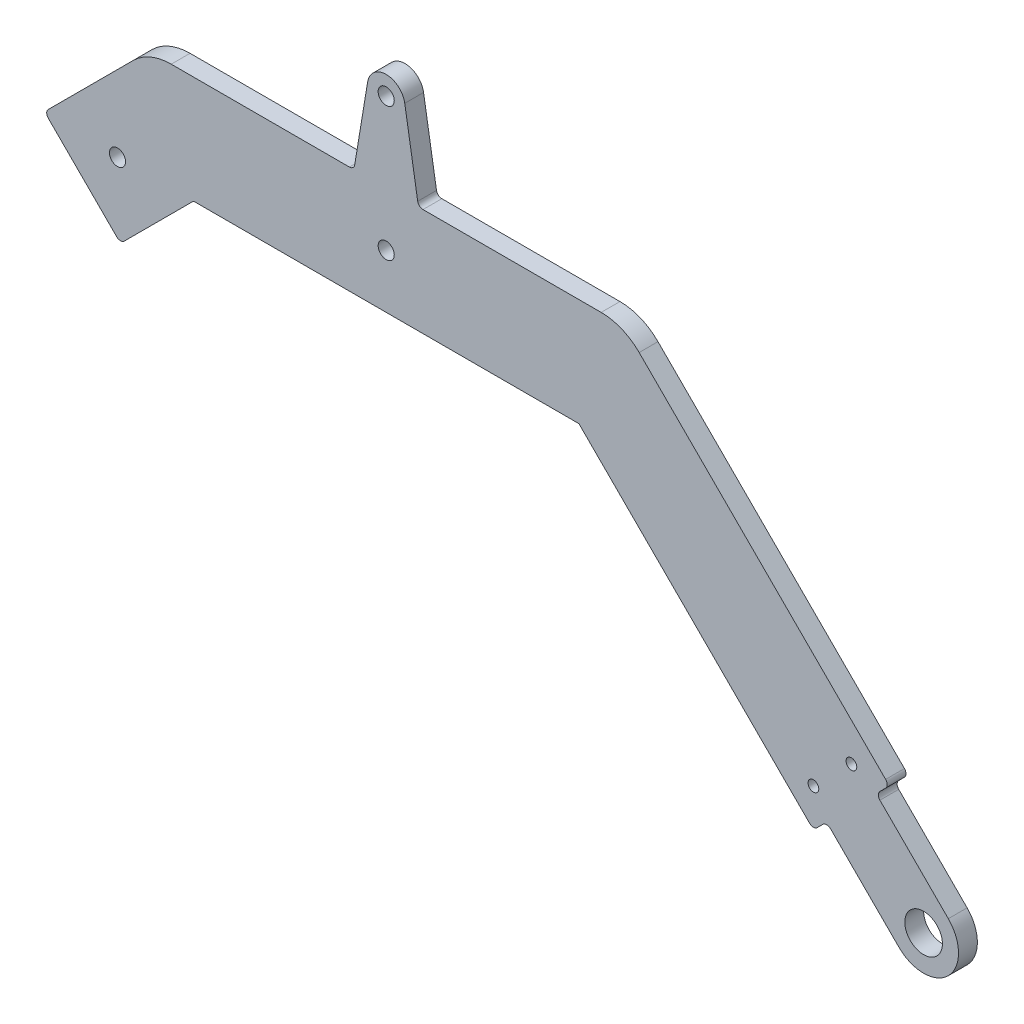
ISO-10303-21;
HEADER;
FILE_DESCRIPTION(('STEP AP214'),'2;1');
FILE_NAME('part.step','',(''),(''),'','','');
FILE_SCHEMA(('AUTOMOTIVE_DESIGN { 1 0 10303 214 1 1 1 1 }'));
ENDSEC;
DATA;
#1=APPLICATION_CONTEXT('core data for automotive mechanical design processes');
#2=APPLICATION_PROTOCOL_DEFINITION('international standard','automotive_design',2000,#1);
#3=PRODUCT_CONTEXT('',#1,'mechanical');
#4=PRODUCT('Part','Part','',(#3));
#5=PRODUCT_RELATED_PRODUCT_CATEGORY('part','',(#4));
#6=PRODUCT_DEFINITION_FORMATION('','',#4);
#7=PRODUCT_DEFINITION_CONTEXT('part definition',#1,'design');
#8=PRODUCT_DEFINITION('design','',#6,#7);
#9=PRODUCT_DEFINITION_SHAPE('','',#8);
#10=(LENGTH_UNIT() NAMED_UNIT(*) SI_UNIT(.MILLI.,.METRE.));
#11=(NAMED_UNIT(*) PLANE_ANGLE_UNIT() SI_UNIT($,.RADIAN.));
#12=(NAMED_UNIT(*) SI_UNIT($,.STERADIAN.) SOLID_ANGLE_UNIT());
#13=UNCERTAINTY_MEASURE_WITH_UNIT(LENGTH_MEASURE(1.E-05),#10,'distance_accuracy_value','');
#14=(GEOMETRIC_REPRESENTATION_CONTEXT(3) GLOBAL_UNCERTAINTY_ASSIGNED_CONTEXT((#13)) GLOBAL_UNIT_ASSIGNED_CONTEXT((#10,
#11,#12)) REPRESENTATION_CONTEXT('',''));
#15=CARTESIAN_POINT('',(0.,0.,0.));
#16=DIRECTION('',(0.,0.,1.));
#17=DIRECTION('',(1.,0.,0.));
#18=AXIS2_PLACEMENT_3D('',#15,#16,#17);
#19=CARTESIAN_POINT('',(100.,0.,3.5));
#20=DIRECTION('',(0.,0.,1.));
#21=DIRECTION('',(1.,0.,0.));
#22=AXIS2_PLACEMENT_3D('',#19,#20,#21);
#23=PLANE('',#22);
#24=CARTESIAN_POINT('',(79.4939033455901,13.4350288425444,3.5));
#25=DIRECTION('',(0.,0.,1.));
#26=DIRECTION('',(1.,0.,0.));
#27=AXIS2_PLACEMENT_3D('',#24,#25,#26);
#28=CIRCLE('',#27,0.999999999999998);
#29=CARTESIAN_POINT('',(80.4939033455901,13.4350288425444,3.5));
#30=VERTEX_POINT('',#29);
#31=EDGE_CURVE('E548',#30,#30,#28,.T.);
#32=ORIENTED_EDGE('',*,*,#31,.F.);
#33=EDGE_LOOP('',(#32));
#34=FACE_BOUND('',#33,.T.);
#35=CARTESIAN_POINT('',(100.,0.,3.5));
#36=DIRECTION('',(0.,0.,1.));
#37=DIRECTION('',(1.,0.,0.));
#38=AXIS2_PLACEMENT_3D('',#35,#36,#37);
#39=CIRCLE('',#38,3.50000000000001);
#40=CARTESIAN_POINT('',(103.5,0.,3.5));
#41=VERTEX_POINT('',#40);
#42=EDGE_CURVE('E532',#41,#41,#39,.T.);
#43=ORIENTED_EDGE('',*,*,#42,.F.);
#44=EDGE_LOOP('',(#43));
#45=FACE_BOUND('',#44,.T.);
#46=CARTESIAN_POINT('',(0.,84.85,3.5));
#47=DIRECTION('',(0.,0.,1.));
#48=DIRECTION('',(1.,0.,0.));
#49=AXIS2_PLACEMENT_3D('',#46,#47,#48);
#50=CIRCLE('',#49,1.5);
#51=CARTESIAN_POINT('',(1.5,84.85,3.5));
#52=VERTEX_POINT('',#51);
#53=EDGE_CURVE('E482',#52,#52,#50,.T.);
#54=ORIENTED_EDGE('',*,*,#53,.F.);
#55=EDGE_LOOP('',(#54));
#56=FACE_BOUND('',#55,.T.);
#57=DIRECTION('',(-0.707106781186547,-0.707106781186548,0.));
#58=VECTOR('',#57,1.);
#59=CARTESIAN_POINT('',(-44.1421356237309,70.,3.5));
#60=LINE('',#59,#58);
#61=CARTESIAN_POINT('',(-47.0710678118655,67.0710678118655,3.5));
#62=VERTEX_POINT('',#61);
#63=CARTESIAN_POINT('',(-62.8804653251744,51.2616702985565,3.5));
#64=VERTEX_POINT('',#63);
#65=EDGE_CURVE('E489',#62,#64,#60,.T.);
#66=ORIENTED_EDGE('',*,*,#65,.T.);
#67=CARTESIAN_POINT('',(-62.1733585439879,50.55456351737,3.5));
#68=DIRECTION('',(0.,0.,1.));
#69=DIRECTION('',(1.,0.,0.));
#70=AXIS2_PLACEMENT_3D('',#67,#68,#69);
#71=CIRCLE('',#70,1.);
#72=CARTESIAN_POINT('',(-62.8804653251744,49.8474567361834,3.5));
#73=VERTEX_POINT('',#72);
#74=EDGE_CURVE('E332',#64,#73,#71,.T.);
#75=ORIENTED_EDGE('',*,*,#74,.T.);
#76=DIRECTION('',(0.707106781186547,-0.707106781186548,0.));
#77=VECTOR('',#76,1.);
#78=CARTESIAN_POINT('',(-63.587572106361,50.55456351737,3.5));
#79=LINE('',#78,#77);
#80=CARTESIAN_POINT('',(-50.1525432638166,37.1195346748256,3.5));
#81=VERTEX_POINT('',#80);
#82=EDGE_CURVE('E485',#73,#81,#79,.T.);
#83=ORIENTED_EDGE('',*,*,#82,.T.);
#84=CARTESIAN_POINT('',(-49.44543648263,37.8266414560121,3.5));
#85=DIRECTION('',(0.,0.,1.));
#86=DIRECTION('',(1.,0.,0.));
#87=AXIS2_PLACEMENT_3D('',#84,#85,#86);
#88=CIRCLE('',#87,1.);
#89=CARTESIAN_POINT('',(-48.7383297014435,37.1195346748256,3.5));
#90=VERTEX_POINT('',#89);
#91=EDGE_CURVE('E329',#81,#90,#88,.T.);
#92=ORIENTED_EDGE('',*,*,#91,.T.);
#93=DIRECTION('',(0.707106781186547,0.707106781186548,0.));
#94=VECTOR('',#93,1.);
#95=CARTESIAN_POINT('',(-49.44543648263,36.412427893639,3.5));
#96=LINE('',#95,#94);
#97=CARTESIAN_POINT('',(-35.857864376269,50.,3.5));
#98=VERTEX_POINT('',#97);
#99=EDGE_CURVE('E232',#90,#98,#96,.T.);
#100=ORIENTED_EDGE('',*,*,#99,.T.);
#101=DIRECTION('',(1.,0.,0.));
#102=VECTOR('',#101,1.);
#103=CARTESIAN_POINT('',(-35.857864376269,50.,3.5));
#104=LINE('',#103,#102);
#105=CARTESIAN_POINT('',(35.8578643762691,50.,3.5));
#106=VERTEX_POINT('',#105);
#107=EDGE_CURVE('E226',#98,#106,#104,.T.);
#108=ORIENTED_EDGE('',*,*,#107,.T.);
#109=DIRECTION('',(0.707106781186548,-0.707106781186548,0.));
#110=VECTOR('',#109,1.);
#111=CARTESIAN_POINT('',(35.8578643762691,50.,3.5));
#112=LINE('',#111,#110);
#113=CARTESIAN_POINT('',(78.7867965644036,7.07106781186545,3.5));
#114=VERTEX_POINT('',#113);
#115=EDGE_CURVE('E213',#106,#114,#112,.T.);
#116=ORIENTED_EDGE('',*,*,#115,.T.);
#117=CARTESIAN_POINT('',(79.4939033455901,7.77817459305201,3.5));
#118=DIRECTION('',(0.,0.,1.));
#119=DIRECTION('',(1.,0.,0.));
#120=AXIS2_PLACEMENT_3D('',#117,#118,#119);
#121=CIRCLE('',#120,1.);
#122=CARTESIAN_POINT('',(80.2010101267767,7.07106781186547,3.5));
#123=VERTEX_POINT('',#122);
#124=EDGE_CURVE('E326',#114,#123,#121,.T.);
#125=ORIENTED_EDGE('',*,*,#124,.T.);
#126=DIRECTION('',(0.707106781186545,0.70710678118655,0.));
#127=VECTOR('',#126,1.);
#128=CARTESIAN_POINT('',(79.4939033455901,6.36396103067892,3.5));
#129=LINE('',#128,#127);
#130=CARTESIAN_POINT('',(81.2616702985566,8.13172798364534,3.5));
#131=VERTEX_POINT('',#130);
#132=EDGE_CURVE('E225',#123,#131,#129,.T.);
#133=ORIENTED_EDGE('',*,*,#132,.T.);
#134=CARTESIAN_POINT('',(81.9687770797431,7.4246212024588,3.5));
#135=DIRECTION('',(0.,0.,1.));
#136=DIRECTION('',(1.,0.,0.));
#137=AXIS2_PLACEMENT_3D('',#134,#135,#136);
#138=CIRCLE('',#137,1.);
#139=CARTESIAN_POINT('',(82.6758838609296,8.13172798364534,3.5));
#140=VERTEX_POINT('',#139);
#141=EDGE_CURVE('E355',#131,#140,#138,.F.);
#142=ORIENTED_EDGE('',*,*,#141,.T.);
#143=DIRECTION('',(0.707106781186545,-0.70710678118655,0.));
#144=VECTOR('',#143,1.);
#145=CARTESIAN_POINT('',(81.9687770797431,8.83883476483189,3.5));
#146=LINE('',#145,#144);
#147=CARTESIAN_POINT('',(95.4038059222874,-4.59619407771253,3.5));
#148=VERTEX_POINT('',#147);
#149=EDGE_CURVE('E514',#140,#148,#146,.T.);
#150=ORIENTED_EDGE('',*,*,#149,.T.);
#151=CARTESIAN_POINT('',(100.,0.,3.5));
#152=DIRECTION('',(0.,0.,1.));
#153=DIRECTION('',(1.,0.,0.));
#154=AXIS2_PLACEMENT_3D('',#151,#152,#153);
#155=CIRCLE('',#154,6.5);
#156=CARTESIAN_POINT('',(104.596194077713,4.59619407771258,3.5));
#157=VERTEX_POINT('',#156);
#158=EDGE_CURVE('E511',#148,#157,#155,.T.);
#159=ORIENTED_EDGE('',*,*,#158,.T.);
#160=DIRECTION('',(-0.707106781186548,0.707106781186547,0.));
#161=VECTOR('',#160,1.);
#162=CARTESIAN_POINT('',(104.596194077713,4.59619407771258,3.5));
#163=LINE('',#162,#161);
#164=CARTESIAN_POINT('',(91.8682720163547,17.3241161390704,3.5));
#165=VERTEX_POINT('',#164);
#166=EDGE_CURVE('E456',#157,#165,#163,.T.);
#167=ORIENTED_EDGE('',*,*,#166,.T.);
#168=CARTESIAN_POINT('',(92.5753787975413,18.031222920257,3.5));
#169=DIRECTION('',(0.,0.,1.));
#170=DIRECTION('',(1.,0.,0.));
#171=AXIS2_PLACEMENT_3D('',#168,#169,#170);
#172=CIRCLE('',#171,1.);
#173=CARTESIAN_POINT('',(91.8682720163547,18.7383297014435,3.5));
#174=VERTEX_POINT('',#173);
#175=EDGE_CURVE('E304',#165,#174,#172,.F.);
#176=ORIENTED_EDGE('',*,*,#175,.T.);
#177=DIRECTION('',(0.707106781186551,0.707106781186544,0.));
#178=VECTOR('',#177,1.);
#179=CARTESIAN_POINT('',(91.1611652351682,18.031222920257,3.5));
#180=LINE('',#179,#178);
#181=CARTESIAN_POINT('',(92.9289321881345,19.7989898732233,3.5));
#182=VERTEX_POINT('',#181);
#183=EDGE_CURVE('E505',#174,#182,#180,.T.);
#184=ORIENTED_EDGE('',*,*,#183,.T.);
#185=CARTESIAN_POINT('',(92.221825406948,20.5060966544099,3.5));
#186=DIRECTION('',(0.,0.,1.));
#187=DIRECTION('',(1.,0.,0.));
#188=AXIS2_PLACEMENT_3D('',#185,#186,#187);
#189=CIRCLE('',#188,1.);
#190=CARTESIAN_POINT('',(92.9289321881345,21.2132034355964,3.5));
#191=VERTEX_POINT('',#190);
#192=EDGE_CURVE('E295',#182,#191,#189,.T.);
#193=ORIENTED_EDGE('',*,*,#192,.T.);
#194=DIRECTION('',(-0.707106781186547,0.707106781186548,0.));
#195=VECTOR('',#194,1.);
#196=CARTESIAN_POINT('',(93.6360389693211,20.5060966544099,3.5));
#197=LINE('',#196,#195);
#198=CARTESIAN_POINT('',(47.0710678118655,67.0710678118655,3.5));
#199=VERTEX_POINT('',#198);
#200=EDGE_CURVE('E502',#191,#199,#197,.T.);
#201=ORIENTED_EDGE('',*,*,#200,.T.);
#202=CARTESIAN_POINT('',(40.,60.,3.5));
#203=DIRECTION('',(0.,0.,1.));
#204=DIRECTION('',(1.,0.,0.));
#205=AXIS2_PLACEMENT_3D('',#202,#203,#204);
#206=CIRCLE('',#205,10.);
#207=CARTESIAN_POINT('',(40.,70.,3.5));
#208=VERTEX_POINT('',#207);
#209=EDGE_CURVE('E267',#199,#208,#206,.T.);
#210=ORIENTED_EDGE('',*,*,#209,.T.);
#211=DIRECTION('',(-1.,0.,0.));
#212=VECTOR('',#211,1.);
#213=CARTESIAN_POINT('',(44.142135623731,70.,3.5));
#214=LINE('',#213,#212);
#215=CARTESIAN_POINT('',(6.84838937711763,70.,3.5));
#216=VERTEX_POINT('',#215);
#217=EDGE_CURVE('E383',#208,#216,#214,.T.);
#218=ORIENTED_EDGE('',*,*,#217,.T.);
#219=CARTESIAN_POINT('',(6.84838937711763,71.,3.5));
#220=DIRECTION('',(0.,0.,1.));
#221=DIRECTION('',(1.,0.,0.));
#222=AXIS2_PLACEMENT_3D('',#219,#220,#221);
#223=CIRCLE('',#222,1.);
#224=CARTESIAN_POINT('',(5.8617550329968,70.8370500966516,3.5));
#225=VERTEX_POINT('',#224);
#226=EDGE_CURVE('E374',#216,#225,#223,.F.);
#227=ORIENTED_EDGE('',*,*,#226,.T.);
#228=DIRECTION('',(-0.16294990334848,0.98663434412082,0.));
#229=VECTOR('',#228,1.);
#230=CARTESIAN_POINT('',(3.45322020442287,85.4203246617197,3.5));
#231=LINE('',#230,#229);
#232=CARTESIAN_POINT('',(3.45322020442287,85.4203246617197,3.5));
#233=VERTEX_POINT('',#232);
#234=EDGE_CURVE('E380',#225,#233,#231,.T.);
#235=ORIENTED_EDGE('',*,*,#234,.T.);
#236=CARTESIAN_POINT('',(0.,84.85,3.5));
#237=DIRECTION('',(0.,0.,1.));
#238=DIRECTION('',(1.,0.,0.));
#239=AXIS2_PLACEMENT_3D('',#236,#237,#238);
#240=CIRCLE('',#239,3.5);
#241=CARTESIAN_POINT('',(-3.45322020442287,85.4203246617197,3.5));
#242=VERTEX_POINT('',#241);
#243=EDGE_CURVE('E394',#233,#242,#240,.T.);
#244=ORIENTED_EDGE('',*,*,#243,.T.);
#245=DIRECTION('',(-0.16294990334848,-0.98663434412082,0.));
#246=VECTOR('',#245,1.);
#247=CARTESIAN_POINT('',(-3.45322020442287,85.4203246617197,3.5));
#248=LINE('',#247,#246);
#249=CARTESIAN_POINT('',(-5.8617550329968,70.8370500966516,3.5));
#250=VERTEX_POINT('',#249);
#251=EDGE_CURVE('E495',#242,#250,#248,.T.);
#252=ORIENTED_EDGE('',*,*,#251,.T.);
#253=CARTESIAN_POINT('',(-6.84838937711762,71.,3.5));
#254=DIRECTION('',(0.,0.,1.));
#255=DIRECTION('',(1.,0.,0.));
#256=AXIS2_PLACEMENT_3D('',#253,#254,#255);
#257=CIRCLE('',#256,1.);
#258=CARTESIAN_POINT('',(-6.84838937711762,70.,3.5));
#259=VERTEX_POINT('',#258);
#260=EDGE_CURVE('E11',#250,#259,#257,.F.);
#261=ORIENTED_EDGE('',*,*,#260,.T.);
#262=DIRECTION('',(-1.,0.,0.));
#263=VECTOR('',#262,1.);
#264=CARTESIAN_POINT('',(-6.,70.,3.5));
#265=LINE('',#264,#263);
#266=CARTESIAN_POINT('',(-40.,70.,3.5));
#267=VERTEX_POINT('',#266);
#268=EDGE_CURVE('E492',#259,#267,#265,.T.);
#269=ORIENTED_EDGE('',*,*,#268,.T.);
#270=CARTESIAN_POINT('',(-40.,60.,3.5));
#271=DIRECTION('',(0.,0.,1.));
#272=DIRECTION('',(1.,0.,0.));
#273=AXIS2_PLACEMENT_3D('',#270,#271,#272);
#274=CIRCLE('',#273,10.);
#275=EDGE_CURVE('E270',#267,#62,#274,.T.);
#276=ORIENTED_EDGE('',*,*,#275,.T.);
#277=EDGE_LOOP('',(#66,#75,#83,#92,#100,#108,#116,#125,#133,#142,#150,#159,#167,#176,#184,#193,
#201,#210,#218,#227,#235,#244,#252,#261,#269,#276));
#278=FACE_BOUND('',#277,.T.);
#279=CARTESIAN_POINT('',(0.,60.,3.5));
#280=DIRECTION('',(0.,0.,1.));
#281=DIRECTION('',(1.,0.,0.));
#282=AXIS2_PLACEMENT_3D('',#279,#280,#281);
#283=CIRCLE('',#282,1.5);
#284=CARTESIAN_POINT('',(1.50000000000002,60.,3.5));
#285=VERTEX_POINT('',#284);
#286=EDGE_CURVE('E524',#285,#285,#283,.T.);
#287=ORIENTED_EDGE('',*,*,#286,.F.);
#288=EDGE_LOOP('',(#287));
#289=FACE_BOUND('',#288,.T.);
#290=CARTESIAN_POINT('',(86.5649711574556,20.5060966544099,3.5));
#291=DIRECTION('',(0.,0.,1.));
#292=DIRECTION('',(1.,0.,0.));
#293=AXIS2_PLACEMENT_3D('',#290,#291,#292);
#294=CIRCLE('',#293,0.999999999999998);
#295=CARTESIAN_POINT('',(87.5649711574556,20.5060966544099,3.5));
#296=VERTEX_POINT('',#295);
#297=EDGE_CURVE('E540',#296,#296,#294,.T.);
#298=ORIENTED_EDGE('',*,*,#297,.F.);
#299=EDGE_LOOP('',(#298));
#300=FACE_BOUND('',#299,.T.);
#301=CARTESIAN_POINT('',(-50.,50.,3.5));
#302=DIRECTION('',(0.,0.,1.));
#303=DIRECTION('',(1.,0.,0.));
#304=AXIS2_PLACEMENT_3D('',#301,#302,#303);
#305=CIRCLE('',#304,1.5);
#306=CARTESIAN_POINT('',(-48.5,50.,3.5));
#307=VERTEX_POINT('',#306);
#308=EDGE_CURVE('E556',#307,#307,#305,.T.);
#309=ORIENTED_EDGE('',*,*,#308,.F.);
#310=EDGE_LOOP('',(#309));
#311=FACE_BOUND('',#310,.T.);
#312=ADVANCED_FACE('F39',(#34,#45,#56,#278,#289,#300,#311),#23,.T.);
#313=CARTESIAN_POINT('',(100.,0.,0.));
#314=DIRECTION('',(0.,0.,1.));
#315=DIRECTION('',(1.,0.,0.));
#316=AXIS2_PLACEMENT_3D('',#313,#314,#315);
#317=PLANE('',#316);
#318=DIRECTION('',(0.707106781186547,-0.707106781186548,0.));
#319=VECTOR('',#318,1.);
#320=CARTESIAN_POINT('',(-63.587572106361,50.55456351737,0.));
#321=LINE('',#320,#319);
#322=CARTESIAN_POINT('',(-62.8804653251744,49.8474567361834,0.));
#323=VERTEX_POINT('',#322);
#324=CARTESIAN_POINT('',(-50.1525432638166,37.1195346748256,0.));
#325=VERTEX_POINT('',#324);
#326=EDGE_CURVE('E431',#323,#325,#321,.T.);
#327=ORIENTED_EDGE('',*,*,#326,.F.);
#328=CARTESIAN_POINT('',(-62.1733585439879,50.55456351737,0.));
#329=DIRECTION('',(0.,0.,1.));
#330=DIRECTION('',(1.,0.,0.));
#331=AXIS2_PLACEMENT_3D('',#328,#329,#330);
#332=CIRCLE('',#331,1.);
#333=CARTESIAN_POINT('',(-62.8804653251744,51.2616702985565,0.));
#334=VERTEX_POINT('',#333);
#335=EDGE_CURVE('E320',#323,#334,#332,.F.);
#336=ORIENTED_EDGE('',*,*,#335,.T.);
#337=DIRECTION('',(-0.707106781186547,-0.707106781186548,0.));
#338=VECTOR('',#337,1.);
#339=CARTESIAN_POINT('',(-44.1421356237309,70.,0.));
#340=LINE('',#339,#338);
#341=CARTESIAN_POINT('',(-47.0710678118655,67.0710678118655,0.));
#342=VERTEX_POINT('',#341);
#343=EDGE_CURVE('E427',#342,#334,#340,.T.);
#344=ORIENTED_EDGE('',*,*,#343,.F.);
#345=CARTESIAN_POINT('',(-40.,60.,0.));
#346=DIRECTION('',(0.,0.,1.));
#347=DIRECTION('',(1.,0.,0.));
#348=AXIS2_PLACEMENT_3D('',#345,#346,#347);
#349=CIRCLE('',#348,10.);
#350=CARTESIAN_POINT('',(-40.,70.,0.));
#351=VERTEX_POINT('',#350);
#352=EDGE_CURVE('E259',#342,#351,#349,.F.);
#353=ORIENTED_EDGE('',*,*,#352,.T.);
#354=DIRECTION('',(-1.,0.,0.));
#355=VECTOR('',#354,1.);
#356=CARTESIAN_POINT('',(-6.,70.,0.));
#357=LINE('',#356,#355);
#358=CARTESIAN_POINT('',(-6.84838937711762,70.,0.));
#359=VERTEX_POINT('',#358);
#360=EDGE_CURVE('E424',#359,#351,#357,.T.);
#361=ORIENTED_EDGE('',*,*,#360,.F.);
#362=CARTESIAN_POINT('',(-6.84838937711762,71.,0.));
#363=DIRECTION('',(0.,0.,1.));
#364=DIRECTION('',(1.,0.,0.));
#365=AXIS2_PLACEMENT_3D('',#362,#363,#364);
#366=CIRCLE('',#365,1.);
#367=CARTESIAN_POINT('',(-5.8617550329968,70.8370500966516,0.));
#368=VERTEX_POINT('',#367);
#369=EDGE_CURVE('E48',#359,#368,#366,.T.);
#370=ORIENTED_EDGE('',*,*,#369,.T.);
#371=DIRECTION('',(-0.16294990334848,-0.98663434412082,0.));
#372=VECTOR('',#371,1.);
#373=CARTESIAN_POINT('',(-3.45322020442287,85.4203246617197,0.));
#374=LINE('',#373,#372);
#375=CARTESIAN_POINT('',(-3.45322020442287,85.4203246617197,0.));
#376=VERTEX_POINT('',#375);
#377=EDGE_CURVE('E421',#376,#368,#374,.T.);
#378=ORIENTED_EDGE('',*,*,#377,.F.);
#379=CARTESIAN_POINT('',(0.,84.85,0.));
#380=DIRECTION('',(0.,0.,1.));
#381=DIRECTION('',(1.,0.,0.));
#382=AXIS2_PLACEMENT_3D('',#379,#380,#381);
#383=CIRCLE('',#382,3.5);
#384=CARTESIAN_POINT('',(3.45322020442287,85.4203246617197,0.));
#385=VERTEX_POINT('',#384);
#386=EDGE_CURVE('E413',#385,#376,#383,.T.);
#387=ORIENTED_EDGE('',*,*,#386,.F.);
#388=DIRECTION('',(-0.16294990334848,0.98663434412082,0.));
#389=VECTOR('',#388,1.);
#390=CARTESIAN_POINT('',(3.45322020442287,85.4203246617197,0.));
#391=LINE('',#390,#389);
#392=CARTESIAN_POINT('',(5.8617550329968,70.8370500966516,0.));
#393=VERTEX_POINT('',#392);
#394=EDGE_CURVE('E404',#393,#385,#391,.T.);
#395=ORIENTED_EDGE('',*,*,#394,.F.);
#396=CARTESIAN_POINT('',(6.84838937711763,71.,0.));
#397=DIRECTION('',(0.,0.,1.));
#398=DIRECTION('',(1.,0.,0.));
#399=AXIS2_PLACEMENT_3D('',#396,#397,#398);
#400=CIRCLE('',#399,1.);
#401=CARTESIAN_POINT('',(6.84838937711763,70.,0.));
#402=VERTEX_POINT('',#401);
#403=EDGE_CURVE('E371',#393,#402,#400,.T.);
#404=ORIENTED_EDGE('',*,*,#403,.T.);
#405=DIRECTION('',(-1.,0.,0.));
#406=VECTOR('',#405,1.);
#407=CARTESIAN_POINT('',(44.142135623731,70.,0.));
#408=LINE('',#407,#406);
#409=CARTESIAN_POINT('',(40.,70.,0.));
#410=VERTEX_POINT('',#409);
#411=EDGE_CURVE('E402',#410,#402,#408,.T.);
#412=ORIENTED_EDGE('',*,*,#411,.F.);
#413=CARTESIAN_POINT('',(40.,60.,0.));
#414=DIRECTION('',(0.,0.,1.));
#415=DIRECTION('',(1.,0.,0.));
#416=AXIS2_PLACEMENT_3D('',#413,#414,#415);
#417=CIRCLE('',#416,10.);
#418=CARTESIAN_POINT('',(47.0710678118655,67.0710678118655,0.));
#419=VERTEX_POINT('',#418);
#420=EDGE_CURVE('E249',#410,#419,#417,.F.);
#421=ORIENTED_EDGE('',*,*,#420,.T.);
#422=DIRECTION('',(-0.707106781186547,0.707106781186548,0.));
#423=VECTOR('',#422,1.);
#424=CARTESIAN_POINT('',(93.6360389693211,20.5060966544099,0.));
#425=LINE('',#424,#423);
#426=CARTESIAN_POINT('',(92.9289321881345,21.2132034355964,0.));
#427=VERTEX_POINT('',#426);
#428=EDGE_CURVE('E409',#427,#419,#425,.T.);
#429=ORIENTED_EDGE('',*,*,#428,.F.);
#430=CARTESIAN_POINT('',(92.221825406948,20.5060966544099,0.));
#431=DIRECTION('',(0.,0.,1.));
#432=DIRECTION('',(1.,0.,0.));
#433=AXIS2_PLACEMENT_3D('',#430,#431,#432);
#434=CIRCLE('',#433,1.);
#435=CARTESIAN_POINT('',(92.9289321881345,19.7989898732233,0.));
#436=VERTEX_POINT('',#435);
#437=EDGE_CURVE('E285',#427,#436,#434,.F.);
#438=ORIENTED_EDGE('',*,*,#437,.T.);
#439=DIRECTION('',(0.707106781186551,0.707106781186544,0.));
#440=VECTOR('',#439,1.);
#441=CARTESIAN_POINT('',(91.1611652351682,18.031222920257,0.));
#442=LINE('',#441,#440);
#443=CARTESIAN_POINT('',(91.8682720163547,18.7383297014435,0.));
#444=VERTEX_POINT('',#443);
#445=EDGE_CURVE('E415',#444,#436,#442,.T.);
#446=ORIENTED_EDGE('',*,*,#445,.F.);
#447=CARTESIAN_POINT('',(92.5753787975413,18.031222920257,0.));
#448=DIRECTION('',(0.,0.,1.));
#449=DIRECTION('',(1.,0.,0.));
#450=AXIS2_PLACEMENT_3D('',#447,#448,#449);
#451=CIRCLE('',#450,1.);
#452=CARTESIAN_POINT('',(91.8682720163547,17.3241161390704,0.));
#453=VERTEX_POINT('',#452);
#454=EDGE_CURVE('E301',#444,#453,#451,.T.);
#455=ORIENTED_EDGE('',*,*,#454,.T.);
#456=DIRECTION('',(-0.707106781186548,0.707106781186547,0.));
#457=VECTOR('',#456,1.);
#458=CARTESIAN_POINT('',(104.596194077713,4.59619407771258,0.));
#459=LINE('',#458,#457);
#460=CARTESIAN_POINT('',(104.596194077713,4.59619407771258,0.));
#461=VERTEX_POINT('',#460);
#462=EDGE_CURVE('E453',#461,#453,#459,.T.);
#463=ORIENTED_EDGE('',*,*,#462,.F.);
#464=CARTESIAN_POINT('',(100.,0.,0.));
#465=DIRECTION('',(0.,0.,1.));
#466=DIRECTION('',(1.,0.,0.));
#467=AXIS2_PLACEMENT_3D('',#464,#465,#466);
#468=CIRCLE('',#467,6.5);
#469=CARTESIAN_POINT('',(95.4038059222874,-4.59619407771253,0.));
#470=VERTEX_POINT('',#469);
#471=EDGE_CURVE('E461',#470,#461,#468,.T.);
#472=ORIENTED_EDGE('',*,*,#471,.F.);
#473=DIRECTION('',(0.707106781186545,-0.70710678118655,0.));
#474=VECTOR('',#473,1.);
#475=CARTESIAN_POINT('',(81.9687770797431,8.83883476483189,0.));
#476=LINE('',#475,#474);
#477=CARTESIAN_POINT('',(82.6758838609296,8.13172798364534,0.));
#478=VERTEX_POINT('',#477);
#479=EDGE_CURVE('E468',#478,#470,#476,.T.);
#480=ORIENTED_EDGE('',*,*,#479,.F.);
#481=CARTESIAN_POINT('',(81.9687770797431,7.4246212024588,0.));
#482=DIRECTION('',(0.,0.,1.));
#483=DIRECTION('',(1.,0.,0.));
#484=AXIS2_PLACEMENT_3D('',#481,#482,#483);
#485=CIRCLE('',#484,1.);
#486=CARTESIAN_POINT('',(81.2616702985566,8.13172798364534,0.));
#487=VERTEX_POINT('',#486);
#488=EDGE_CURVE('E352',#478,#487,#485,.T.);
#489=ORIENTED_EDGE('',*,*,#488,.T.);
#490=DIRECTION('',(0.707106781186545,0.70710678118655,0.));
#491=VECTOR('',#490,1.);
#492=CARTESIAN_POINT('',(79.4939033455901,6.36396103067892,0.));
#493=LINE('',#492,#491);
#494=CARTESIAN_POINT('',(80.2010101267767,7.07106781186547,0.));
#495=VERTEX_POINT('',#494);
#496=EDGE_CURVE('E473',#495,#487,#493,.T.);
#497=ORIENTED_EDGE('',*,*,#496,.F.);
#498=CARTESIAN_POINT('',(79.4939033455901,7.77817459305201,0.));
#499=DIRECTION('',(0.,0.,1.));
#500=DIRECTION('',(1.,0.,0.));
#501=AXIS2_PLACEMENT_3D('',#498,#499,#500);
#502=CIRCLE('',#501,1.);
#503=CARTESIAN_POINT('',(78.7867965644036,7.07106781186545,0.));
#504=VERTEX_POINT('',#503);
#505=EDGE_CURVE('E314',#495,#504,#502,.F.);
#506=ORIENTED_EDGE('',*,*,#505,.T.);
#507=DIRECTION('',(0.707106781186548,-0.707106781186548,0.));
#508=VECTOR('',#507,1.);
#509=CARTESIAN_POINT('',(35.8578643762691,50.,0.));
#510=LINE('',#509,#508);
#511=CARTESIAN_POINT('',(35.8578643762691,50.,0.));
#512=VERTEX_POINT('',#511);
#513=EDGE_CURVE('E477',#512,#504,#510,.T.);
#514=ORIENTED_EDGE('',*,*,#513,.F.);
#515=DIRECTION('',(1.,0.,0.));
#516=VECTOR('',#515,1.);
#517=CARTESIAN_POINT('',(-35.857864376269,50.,0.));
#518=LINE('',#517,#516);
#519=CARTESIAN_POINT('',(-35.857864376269,50.,0.));
#520=VERTEX_POINT('',#519);
#521=EDGE_CURVE('E241',#520,#512,#518,.T.);
#522=ORIENTED_EDGE('',*,*,#521,.F.);
#523=DIRECTION('',(0.707106781186547,0.707106781186548,0.));
#524=VECTOR('',#523,1.);
#525=CARTESIAN_POINT('',(-49.44543648263,36.412427893639,0.));
#526=LINE('',#525,#524);
#527=CARTESIAN_POINT('',(-48.7383297014435,37.1195346748256,0.));
#528=VERTEX_POINT('',#527);
#529=EDGE_CURVE('E237',#528,#520,#526,.T.);
#530=ORIENTED_EDGE('',*,*,#529,.F.);
#531=CARTESIAN_POINT('',(-49.44543648263,37.8266414560121,0.));
#532=DIRECTION('',(0.,0.,1.));
#533=DIRECTION('',(1.,0.,0.));
#534=AXIS2_PLACEMENT_3D('',#531,#532,#533);
#535=CIRCLE('',#534,1.);
#536=EDGE_CURVE('E317',#528,#325,#535,.F.);
#537=ORIENTED_EDGE('',*,*,#536,.T.);
#538=EDGE_LOOP('',(#327,#336,#344,#353,#361,#370,#378,#387,#395,#404,#412,#421,#429,#438,#446,
#455,#463,#472,#480,#489,#497,#506,#514,#522,#530,#537));
#539=FACE_BOUND('',#538,.T.);
#540=CARTESIAN_POINT('',(0.,84.85,0.));
#541=DIRECTION('',(0.,0.,1.));
#542=DIRECTION('',(1.,0.,0.));
#543=AXIS2_PLACEMENT_3D('',#540,#541,#542);
#544=CIRCLE('',#543,1.5);
#545=CARTESIAN_POINT('',(1.5,84.85,0.));
#546=VERTEX_POINT('',#545);
#547=EDGE_CURVE('E520',#546,#546,#544,.T.);
#548=ORIENTED_EDGE('',*,*,#547,.T.);
#549=EDGE_LOOP('',(#548));
#550=FACE_BOUND('',#549,.T.);
#551=CARTESIAN_POINT('',(0.,60.,0.));
#552=DIRECTION('',(0.,0.,1.));
#553=DIRECTION('',(1.,0.,0.));
#554=AXIS2_PLACEMENT_3D('',#551,#552,#553);
#555=CIRCLE('',#554,1.5);
#556=CARTESIAN_POINT('',(1.50000000000002,60.,0.));
#557=VERTEX_POINT('',#556);
#558=EDGE_CURVE('E528',#557,#557,#555,.T.);
#559=ORIENTED_EDGE('',*,*,#558,.T.);
#560=EDGE_LOOP('',(#559));
#561=FACE_BOUND('',#560,.T.);
#562=CARTESIAN_POINT('',(100.,0.,0.));
#563=DIRECTION('',(0.,0.,1.));
#564=DIRECTION('',(1.,0.,0.));
#565=AXIS2_PLACEMENT_3D('',#562,#563,#564);
#566=CIRCLE('',#565,3.50000000000001);
#567=CARTESIAN_POINT('',(103.5,0.,0.));
#568=VERTEX_POINT('',#567);
#569=EDGE_CURVE('E536',#568,#568,#566,.T.);
#570=ORIENTED_EDGE('',*,*,#569,.T.);
#571=EDGE_LOOP('',(#570));
#572=FACE_BOUND('',#571,.T.);
#573=CARTESIAN_POINT('',(86.5649711574556,20.5060966544099,0.));
#574=DIRECTION('',(0.,0.,1.));
#575=DIRECTION('',(1.,0.,0.));
#576=AXIS2_PLACEMENT_3D('',#573,#574,#575);
#577=CIRCLE('',#576,0.999999999999998);
#578=CARTESIAN_POINT('',(87.5649711574556,20.5060966544099,0.));
#579=VERTEX_POINT('',#578);
#580=EDGE_CURVE('E544',#579,#579,#577,.T.);
#581=ORIENTED_EDGE('',*,*,#580,.T.);
#582=EDGE_LOOP('',(#581));
#583=FACE_BOUND('',#582,.T.);
#584=CARTESIAN_POINT('',(79.4939033455901,13.4350288425444,0.));
#585=DIRECTION('',(0.,0.,1.));
#586=DIRECTION('',(1.,0.,0.));
#587=AXIS2_PLACEMENT_3D('',#584,#585,#586);
#588=CIRCLE('',#587,0.999999999999998);
#589=CARTESIAN_POINT('',(80.4939033455901,13.4350288425444,0.));
#590=VERTEX_POINT('',#589);
#591=EDGE_CURVE('E552',#590,#590,#588,.T.);
#592=ORIENTED_EDGE('',*,*,#591,.T.);
#593=EDGE_LOOP('',(#592));
#594=FACE_BOUND('',#593,.T.);
#595=CARTESIAN_POINT('',(-50.,50.,0.));
#596=DIRECTION('',(0.,0.,1.));
#597=DIRECTION('',(1.,0.,0.));
#598=AXIS2_PLACEMENT_3D('',#595,#596,#597);
#599=CIRCLE('',#598,1.5);
#600=CARTESIAN_POINT('',(-48.5,50.,0.));
#601=VERTEX_POINT('',#600);
#602=EDGE_CURVE('E560',#601,#601,#599,.T.);
#603=ORIENTED_EDGE('',*,*,#602,.T.);
#604=EDGE_LOOP('',(#603));
#605=FACE_BOUND('',#604,.T.);
#606=ADVANCED_FACE('F400',(#539,#550,#561,#572,#583,#594,#605),#317,.F.);
#607=CARTESIAN_POINT('',(-35.857864376269,50.,3.5));
#608=DIRECTION('',(0.,1.,0.));
#609=DIRECTION('',(0.,0.,1.));
#610=AXIS2_PLACEMENT_3D('',#607,#608,#609);
#611=PLANE('',#610);
#612=ORIENTED_EDGE('',*,*,#521,.T.);
#613=DIRECTION('',(0.,0.,-1.));
#614=VECTOR('',#613,1.);
#615=CARTESIAN_POINT('',(35.8578643762691,50.,3.5));
#616=LINE('',#615,#614);
#617=EDGE_CURVE('E218',#106,#512,#616,.T.);
#618=ORIENTED_EDGE('',*,*,#617,.F.);
#619=ORIENTED_EDGE('',*,*,#107,.F.);
#620=DIRECTION('',(0.,0.,-1.));
#621=VECTOR('',#620,1.);
#622=CARTESIAN_POINT('',(-35.857864376269,50.,3.5));
#623=LINE('',#622,#621);
#624=EDGE_CURVE('E437',#98,#520,#623,.T.);
#625=ORIENTED_EDGE('',*,*,#624,.T.);
#626=EDGE_LOOP('',(#612,#618,#619,#625));
#627=FACE_BOUND('',#626,.T.);
#628=ADVANCED_FACE('F239',(#627),#611,.F.);
#629=CARTESIAN_POINT('',(35.8578643762691,50.,3.5));
#630=DIRECTION('',(0.707106781186548,0.707106781186547,0.));
#631=DIRECTION('',(-0.707106781186547,0.707106781186548,0.));
#632=AXIS2_PLACEMENT_3D('',#629,#630,#631);
#633=PLANE('',#632);
#634=ORIENTED_EDGE('',*,*,#513,.T.);
#635=DIRECTION('',(0.,0.,-1.));
#636=VECTOR('',#635,1.);
#637=CARTESIAN_POINT('',(78.7867965644036,7.07106781186546,3.5));
#638=LINE('',#637,#636);
#639=EDGE_CURVE('E221',#504,#114,#638,.F.);
#640=ORIENTED_EDGE('',*,*,#639,.T.);
#641=ORIENTED_EDGE('',*,*,#115,.F.);
#642=ORIENTED_EDGE('',*,*,#617,.T.);
#643=EDGE_LOOP('',(#634,#640,#641,#642));
#644=FACE_BOUND('',#643,.T.);
#645=ADVANCED_FACE('F216',(#644),#633,.F.);
#646=CARTESIAN_POINT('',(79.4939033455901,6.36396103067892,3.5));
#647=DIRECTION('',(-0.70710678118655,0.707106781186545,0.));
#648=DIRECTION('',(-0.707106781186545,-0.70710678118655,0.));
#649=AXIS2_PLACEMENT_3D('',#646,#647,#648);
#650=PLANE('',#649);
#651=ORIENTED_EDGE('',*,*,#132,.F.);
#652=DIRECTION('',(0.,0.,-1.));
#653=VECTOR('',#652,1.);
#654=CARTESIAN_POINT('',(80.2010101267767,7.07106781186547,3.5));
#655=LINE('',#654,#653);
#656=EDGE_CURVE('E342',#123,#495,#655,.T.);
#657=ORIENTED_EDGE('',*,*,#656,.T.);
#658=ORIENTED_EDGE('',*,*,#496,.T.);
#659=DIRECTION('',(0.,0.,-1.));
#660=VECTOR('',#659,1.);
#661=CARTESIAN_POINT('',(81.2616702985566,8.13172798364534,3.5));
#662=LINE('',#661,#660);
#663=EDGE_CURVE('E339',#487,#131,#662,.F.);
#664=ORIENTED_EDGE('',*,*,#663,.T.);
#665=EDGE_LOOP('',(#651,#657,#658,#664));
#666=FACE_BOUND('',#665,.T.);
#667=ADVANCED_FACE('F627',(#666),#650,.F.);
#668=CARTESIAN_POINT('',(81.9687770797431,8.83883476483189,3.5));
#669=DIRECTION('',(0.70710678118655,0.707106781186545,0.));
#670=DIRECTION('',(-0.707106781186545,0.70710678118655,0.));
#671=AXIS2_PLACEMENT_3D('',#668,#669,#670);
#672=PLANE('',#671);
#673=ORIENTED_EDGE('',*,*,#149,.F.);
#674=DIRECTION('',(0.,0.,-1.));
#675=VECTOR('',#674,1.);
#676=CARTESIAN_POINT('',(82.6758838609296,8.13172798364534,0.));
#677=LINE('',#676,#675);
#678=EDGE_CURVE('E348',#140,#478,#677,.T.);
#679=ORIENTED_EDGE('',*,*,#678,.T.);
#680=ORIENTED_EDGE('',*,*,#479,.T.);
#681=DIRECTION('',(0.,0.,-1.));
#682=VECTOR('',#681,1.);
#683=CARTESIAN_POINT('',(95.4038059222874,-4.59619407771253,3.5));
#684=LINE('',#683,#682);
#685=EDGE_CURVE('E244',#148,#470,#684,.T.);
#686=ORIENTED_EDGE('',*,*,#685,.F.);
#687=EDGE_LOOP('',(#673,#679,#680,#686));
#688=FACE_BOUND('',#687,.T.);
#689=ADVANCED_FACE('F624',(#688),#672,.F.);
#690=CARTESIAN_POINT('',(100.,0.,3.5));
#691=DIRECTION('',(0.,0.,-1.));
#692=DIRECTION('',(-1.,0.,0.));
#693=AXIS2_PLACEMENT_3D('',#690,#691,#692);
#694=CYLINDRICAL_SURFACE('',#693,6.5);
#695=ORIENTED_EDGE('',*,*,#471,.T.);
#696=DIRECTION('',(0.,0.,-1.));
#697=VECTOR('',#696,1.);
#698=CARTESIAN_POINT('',(104.596194077713,4.59619407771258,3.5));
#699=LINE('',#698,#697);
#700=EDGE_CURVE('E252',#157,#461,#699,.T.);
#701=ORIENTED_EDGE('',*,*,#700,.F.);
#702=ORIENTED_EDGE('',*,*,#158,.F.);
#703=ORIENTED_EDGE('',*,*,#685,.T.);
#704=EDGE_LOOP('',(#695,#701,#702,#703));
#705=FACE_BOUND('',#704,.T.);
#706=ADVANCED_FACE('F621',(#705),#694,.T.);
#707=CARTESIAN_POINT('',(104.596194077713,4.59619407771258,3.5));
#708=DIRECTION('',(-0.707106781186547,-0.707106781186548,0.));
#709=DIRECTION('',(0.707106781186548,-0.707106781186547,0.));
#710=AXIS2_PLACEMENT_3D('',#707,#708,#709);
#711=PLANE('',#710);
#712=ORIENTED_EDGE('',*,*,#462,.T.);
#713=DIRECTION('',(0.,0.,-1.));
#714=VECTOR('',#713,1.);
#715=CARTESIAN_POINT('',(91.8682720163547,17.3241161390704,3.5));
#716=LINE('',#715,#714);
#717=EDGE_CURVE('E298',#453,#165,#716,.F.);
#718=ORIENTED_EDGE('',*,*,#717,.T.);
#719=ORIENTED_EDGE('',*,*,#166,.F.);
#720=ORIENTED_EDGE('',*,*,#700,.T.);
#721=EDGE_LOOP('',(#712,#718,#719,#720));
#722=FACE_BOUND('',#721,.T.);
#723=ADVANCED_FACE('F452',(#722),#711,.F.);
#724=CARTESIAN_POINT('',(91.1611652351682,18.031222920257,3.5));
#725=DIRECTION('',(-0.707106781186544,0.707106781186551,0.));
#726=DIRECTION('',(-0.707106781186551,-0.707106781186544,0.));
#727=AXIS2_PLACEMENT_3D('',#724,#725,#726);
#728=PLANE('',#727);
#729=ORIENTED_EDGE('',*,*,#445,.T.);
#730=DIRECTION('',(0.,0.,-1.));
#731=VECTOR('',#730,1.);
#732=CARTESIAN_POINT('',(92.9289321881345,19.7989898732233,3.5));
#733=LINE('',#732,#731);
#734=EDGE_CURVE('E292',#436,#182,#733,.F.);
#735=ORIENTED_EDGE('',*,*,#734,.T.);
#736=ORIENTED_EDGE('',*,*,#183,.F.);
#737=DIRECTION('',(0.,0.,-1.));
#738=VECTOR('',#737,1.);
#739=CARTESIAN_POINT('',(91.8682720163547,18.7383297014435,0.));
#740=LINE('',#739,#738);
#741=EDGE_CURVE('E288',#174,#444,#740,.T.);
#742=ORIENTED_EDGE('',*,*,#741,.T.);
#743=EDGE_LOOP('',(#729,#735,#736,#742));
#744=FACE_BOUND('',#743,.T.);
#745=ADVANCED_FACE('F614',(#744),#728,.F.);
#746=CARTESIAN_POINT('',(93.6360389693211,20.5060966544099,3.5));
#747=DIRECTION('',(-0.707106781186548,-0.707106781186548,0.));
#748=DIRECTION('',(0.707106781186547,-0.707106781186548,0.));
#749=AXIS2_PLACEMENT_3D('',#746,#747,#748);
#750=PLANE('',#749);
#751=ORIENTED_EDGE('',*,*,#200,.F.);
#752=DIRECTION('',(0.,0.,-1.));
#753=VECTOR('',#752,1.);
#754=CARTESIAN_POINT('',(92.9289321881345,21.2132034355964,3.5));
#755=LINE('',#754,#753);
#756=EDGE_CURVE('E281',#191,#427,#755,.T.);
#757=ORIENTED_EDGE('',*,*,#756,.T.);
#758=ORIENTED_EDGE('',*,*,#428,.T.);
#759=DIRECTION('',(0.,0.,-1.));
#760=VECTOR('',#759,1.);
#761=CARTESIAN_POINT('',(47.0710678118655,67.0710678118655,3.5));
#762=LINE('',#761,#760);
#763=EDGE_CURVE('E277',#419,#199,#762,.F.);
#764=ORIENTED_EDGE('',*,*,#763,.T.);
#765=EDGE_LOOP('',(#751,#757,#758,#764));
#766=FACE_BOUND('',#765,.T.);
#767=ADVANCED_FACE('F611',(#766),#750,.F.);
#768=CARTESIAN_POINT('',(44.142135623731,70.,3.5));
#769=DIRECTION('',(0.,-1.,0.));
#770=DIRECTION('',(0.,0.,-1.));
#771=AXIS2_PLACEMENT_3D('',#768,#769,#770);
#772=PLANE('',#771);
#773=ORIENTED_EDGE('',*,*,#411,.T.);
#774=DIRECTION('',(0.,0.,-1.));
#775=VECTOR('',#774,1.);
#776=CARTESIAN_POINT('',(6.84838937711763,70.,3.5));
#777=LINE('',#776,#775);
#778=EDGE_CURVE('E362',#402,#216,#777,.F.);
#779=ORIENTED_EDGE('',*,*,#778,.T.);
#780=ORIENTED_EDGE('',*,*,#217,.F.);
#781=DIRECTION('',(0.,0.,-1.));
#782=VECTOR('',#781,1.);
#783=CARTESIAN_POINT('',(40.,70.,3.5));
#784=LINE('',#783,#782);
#785=EDGE_CURVE('E273',#208,#410,#784,.T.);
#786=ORIENTED_EDGE('',*,*,#785,.T.);
#787=EDGE_LOOP('',(#773,#779,#780,#786));
#788=FACE_BOUND('',#787,.T.);
#789=ADVANCED_FACE('F406',(#788),#772,.F.);
#790=CARTESIAN_POINT('',(3.45322020442287,85.4203246617197,3.5));
#791=DIRECTION('',(-0.98663434412082,-0.16294990334848,0.));
#792=DIRECTION('',(0.16294990334848,-0.98663434412082,0.));
#793=AXIS2_PLACEMENT_3D('',#790,#791,#792);
#794=PLANE('',#793);
#795=ORIENTED_EDGE('',*,*,#234,.F.);
#796=DIRECTION('',(0.,0.,-1.));
#797=VECTOR('',#796,1.);
#798=CARTESIAN_POINT('',(5.86175503299681,70.8370500966516,0.));
#799=LINE('',#798,#797);
#800=EDGE_CURVE('E358',#225,#393,#799,.T.);
#801=ORIENTED_EDGE('',*,*,#800,.T.);
#802=ORIENTED_EDGE('',*,*,#394,.T.);
#803=DIRECTION('',(0.,0.,-1.));
#804=VECTOR('',#803,1.);
#805=CARTESIAN_POINT('',(3.45322020442287,85.4203246617197,3.5));
#806=LINE('',#805,#804);
#807=EDGE_CURVE('E391',#233,#385,#806,.T.);
#808=ORIENTED_EDGE('',*,*,#807,.F.);
#809=EDGE_LOOP('',(#795,#801,#802,#808));
#810=FACE_BOUND('',#809,.T.);
#811=ADVANCED_FACE('F388',(#810),#794,.F.);
#812=CARTESIAN_POINT('',(0.,84.85,3.5));
#813=DIRECTION('',(0.,0.,-1.));
#814=DIRECTION('',(-1.,0.,0.));
#815=AXIS2_PLACEMENT_3D('',#812,#813,#814);
#816=CYLINDRICAL_SURFACE('',#815,3.5);
#817=ORIENTED_EDGE('',*,*,#386,.T.);
#818=DIRECTION('',(0.,0.,-1.));
#819=VECTOR('',#818,1.);
#820=CARTESIAN_POINT('',(-3.45322020442287,85.4203246617197,3.5));
#821=LINE('',#820,#819);
#822=EDGE_CURVE('E440',#242,#376,#821,.T.);
#823=ORIENTED_EDGE('',*,*,#822,.F.);
#824=ORIENTED_EDGE('',*,*,#243,.F.);
#825=ORIENTED_EDGE('',*,*,#807,.T.);
#826=EDGE_LOOP('',(#817,#823,#824,#825));
#827=FACE_BOUND('',#826,.T.);
#828=ADVANCED_FACE('F603',(#827),#816,.T.);
#829=CARTESIAN_POINT('',(-3.45322020442287,85.4203246617197,3.5));
#830=DIRECTION('',(0.98663434412082,-0.16294990334848,0.));
#831=DIRECTION('',(0.16294990334848,0.98663434412082,0.));
#832=AXIS2_PLACEMENT_3D('',#829,#830,#831);
#833=PLANE('',#832);
#834=ORIENTED_EDGE('',*,*,#377,.T.);
#835=DIRECTION('',(0.,0.,-1.));
#836=VECTOR('',#835,1.);
#837=CARTESIAN_POINT('',(-5.86175503299681,70.8370500966516,3.5));
#838=LINE('',#837,#836);
#839=EDGE_CURVE('E55',#368,#250,#838,.F.);
#840=ORIENTED_EDGE('',*,*,#839,.T.);
#841=ORIENTED_EDGE('',*,*,#251,.F.);
#842=ORIENTED_EDGE('',*,*,#822,.T.);
#843=EDGE_LOOP('',(#834,#840,#841,#842));
#844=FACE_BOUND('',#843,.T.);
#845=ADVANCED_FACE('F599',(#844),#833,.F.);
#846=CARTESIAN_POINT('',(-6.,70.,3.5));
#847=DIRECTION('',(0.,-1.,0.));
#848=DIRECTION('',(0.,0.,-1.));
#849=AXIS2_PLACEMENT_3D('',#846,#847,#848);
#850=PLANE('',#849);
#851=ORIENTED_EDGE('',*,*,#268,.F.);
#852=DIRECTION('',(0.,0.,-1.));
#853=VECTOR('',#852,1.);
#854=CARTESIAN_POINT('',(-6.84838937711762,70.,0.));
#855=LINE('',#854,#853);
#856=EDGE_CURVE('E365',#259,#359,#855,.T.);
#857=ORIENTED_EDGE('',*,*,#856,.T.);
#858=ORIENTED_EDGE('',*,*,#360,.T.);
#859=DIRECTION('',(0.,0.,-1.));
#860=VECTOR('',#859,1.);
#861=CARTESIAN_POINT('',(-40.,70.,3.5));
#862=LINE('',#861,#860);
#863=EDGE_CURVE('E263',#351,#267,#862,.F.);
#864=ORIENTED_EDGE('',*,*,#863,.T.);
#865=EDGE_LOOP('',(#851,#857,#858,#864));
#866=FACE_BOUND('',#865,.T.);
#867=ADVANCED_FACE('F595',(#866),#850,.F.);
#868=CARTESIAN_POINT('',(-44.1421356237309,70.,3.5));
#869=DIRECTION('',(0.707106781186548,-0.707106781186547,0.));
#870=DIRECTION('',(0.707106781186547,0.707106781186548,0.));
#871=AXIS2_PLACEMENT_3D('',#868,#869,#870);
#872=PLANE('',#871);
#873=ORIENTED_EDGE('',*,*,#343,.T.);
#874=DIRECTION('',(0.,0.,-1.));
#875=VECTOR('',#874,1.);
#876=CARTESIAN_POINT('',(-62.8804653251744,51.2616702985565,3.5));
#877=LINE('',#876,#875);
#878=EDGE_CURVE('E323',#334,#64,#877,.F.);
#879=ORIENTED_EDGE('',*,*,#878,.T.);
#880=ORIENTED_EDGE('',*,*,#65,.F.);
#881=DIRECTION('',(0.,0.,-1.));
#882=VECTOR('',#881,1.);
#883=CARTESIAN_POINT('',(-47.0710678118655,67.0710678118655,3.5));
#884=LINE('',#883,#882);
#885=EDGE_CURVE('E243',#62,#342,#884,.T.);
#886=ORIENTED_EDGE('',*,*,#885,.T.);
#887=EDGE_LOOP('',(#873,#879,#880,#886));
#888=FACE_BOUND('',#887,.T.);
#889=ADVANCED_FACE('F591',(#888),#872,.F.);
#890=CARTESIAN_POINT('',(-63.587572106361,50.55456351737,3.5));
#891=DIRECTION('',(0.707106781186548,0.707106781186547,0.));
#892=DIRECTION('',(-0.707106781186547,0.707106781186548,0.));
#893=AXIS2_PLACEMENT_3D('',#890,#891,#892);
#894=PLANE('',#893);
#895=ORIENTED_EDGE('',*,*,#82,.F.);
#896=DIRECTION('',(0.,0.,-1.));
#897=VECTOR('',#896,1.);
#898=CARTESIAN_POINT('',(-62.8804653251744,49.8474567361834,3.5));
#899=LINE('',#898,#897);
#900=EDGE_CURVE('E310',#73,#323,#899,.T.);
#901=ORIENTED_EDGE('',*,*,#900,.T.);
#902=ORIENTED_EDGE('',*,*,#326,.T.);
#903=DIRECTION('',(0.,0.,-1.));
#904=VECTOR('',#903,1.);
#905=CARTESIAN_POINT('',(-50.1525432638166,37.1195346748256,3.5));
#906=LINE('',#905,#904);
#907=EDGE_CURVE('E307',#325,#81,#906,.F.);
#908=ORIENTED_EDGE('',*,*,#907,.T.);
#909=EDGE_LOOP('',(#895,#901,#902,#908));
#910=FACE_BOUND('',#909,.T.);
#911=ADVANCED_FACE('F587',(#910),#894,.F.);
#912=CARTESIAN_POINT('',(-49.44543648263,36.412427893639,3.5));
#913=DIRECTION('',(-0.707106781186548,0.707106781186547,0.));
#914=DIRECTION('',(-0.707106781186547,-0.707106781186548,0.));
#915=AXIS2_PLACEMENT_3D('',#912,#913,#914);
#916=PLANE('',#915);
#917=ORIENTED_EDGE('',*,*,#99,.F.);
#918=DIRECTION('',(0.,0.,-1.));
#919=VECTOR('',#918,1.);
#920=CARTESIAN_POINT('',(-48.7383297014435,37.1195346748256,3.5));
#921=LINE('',#920,#919);
#922=EDGE_CURVE('E335',#90,#528,#921,.T.);
#923=ORIENTED_EDGE('',*,*,#922,.T.);
#924=ORIENTED_EDGE('',*,*,#529,.T.);
#925=ORIENTED_EDGE('',*,*,#624,.F.);
#926=EDGE_LOOP('',(#917,#923,#924,#925));
#927=FACE_BOUND('',#926,.T.);
#928=ADVANCED_FACE('F584',(#927),#916,.F.);
#929=CARTESIAN_POINT('',(0.,84.85,3.5));
#930=DIRECTION('',(0.,0.,-1.));
#931=DIRECTION('',(-1.,0.,0.));
#932=AXIS2_PLACEMENT_3D('',#929,#930,#931);
#933=CYLINDRICAL_SURFACE('',#932,1.5);
#934=ORIENTED_EDGE('',*,*,#53,.T.);
#935=EDGE_LOOP('',(#934));
#936=FACE_BOUND('',#935,.T.);
#937=ORIENTED_EDGE('',*,*,#547,.F.);
#938=EDGE_LOOP('',(#937));
#939=FACE_BOUND('',#938,.T.);
#940=ADVANCED_FACE('F581',(#936,#939),#933,.F.);
#941=CARTESIAN_POINT('',(0.,60.,3.5));
#942=DIRECTION('',(0.,0.,-1.));
#943=DIRECTION('',(-1.,0.,0.));
#944=AXIS2_PLACEMENT_3D('',#941,#942,#943);
#945=CYLINDRICAL_SURFACE('',#944,1.5);
#946=ORIENTED_EDGE('',*,*,#286,.T.);
#947=EDGE_LOOP('',(#946));
#948=FACE_BOUND('',#947,.T.);
#949=ORIENTED_EDGE('',*,*,#558,.F.);
#950=EDGE_LOOP('',(#949));
#951=FACE_BOUND('',#950,.T.);
#952=ADVANCED_FACE('F892',(#948,#951),#945,.F.);
#953=CARTESIAN_POINT('',(100.,0.,3.5));
#954=DIRECTION('',(0.,0.,-1.));
#955=DIRECTION('',(-1.,0.,0.));
#956=AXIS2_PLACEMENT_3D('',#953,#954,#955);
#957=CYLINDRICAL_SURFACE('',#956,3.50000000000001);
#958=ORIENTED_EDGE('',*,*,#42,.T.);
#959=EDGE_LOOP('',(#958));
#960=FACE_BOUND('',#959,.T.);
#961=ORIENTED_EDGE('',*,*,#569,.F.);
#962=EDGE_LOOP('',(#961));
#963=FACE_BOUND('',#962,.T.);
#964=ADVANCED_FACE('F882',(#960,#963),#957,.F.);
#965=CARTESIAN_POINT('',(86.5649711574556,20.5060966544099,3.5));
#966=DIRECTION('',(0.,0.,-1.));
#967=DIRECTION('',(-1.,0.,0.));
#968=AXIS2_PLACEMENT_3D('',#965,#966,#967);
#969=CYLINDRICAL_SURFACE('',#968,0.999999999999998);
#970=ORIENTED_EDGE('',*,*,#297,.T.);
#971=EDGE_LOOP('',(#970));
#972=FACE_BOUND('',#971,.T.);
#973=ORIENTED_EDGE('',*,*,#580,.F.);
#974=EDGE_LOOP('',(#973));
#975=FACE_BOUND('',#974,.T.);
#976=ADVANCED_FACE('F872',(#972,#975),#969,.F.);
#977=CARTESIAN_POINT('',(79.4939033455901,13.4350288425444,3.5));
#978=DIRECTION('',(0.,0.,-1.));
#979=DIRECTION('',(-1.,0.,0.));
#980=AXIS2_PLACEMENT_3D('',#977,#978,#979);
#981=CYLINDRICAL_SURFACE('',#980,0.999999999999998);
#982=ORIENTED_EDGE('',*,*,#31,.T.);
#983=EDGE_LOOP('',(#982));
#984=FACE_BOUND('',#983,.T.);
#985=ORIENTED_EDGE('',*,*,#591,.F.);
#986=EDGE_LOOP('',(#985));
#987=FACE_BOUND('',#986,.T.);
#988=ADVANCED_FACE('F863',(#984,#987),#981,.F.);
#989=CARTESIAN_POINT('',(-50.,50.,3.5));
#990=DIRECTION('',(0.,0.,-1.));
#991=DIRECTION('',(-1.,0.,0.));
#992=AXIS2_PLACEMENT_3D('',#989,#990,#991);
#993=CYLINDRICAL_SURFACE('',#992,1.5);
#994=ORIENTED_EDGE('',*,*,#308,.T.);
#995=EDGE_LOOP('',(#994));
#996=FACE_BOUND('',#995,.T.);
#997=ORIENTED_EDGE('',*,*,#602,.F.);
#998=EDGE_LOOP('',(#997));
#999=FACE_BOUND('',#998,.T.);
#1000=ADVANCED_FACE('F568',(#996,#999),#993,.F.);
#1001=CARTESIAN_POINT('',(-40.,60.,3.5));
#1002=DIRECTION('',(0.,0.,-1.));
#1003=DIRECTION('',(-1.,0.,0.));
#1004=AXIS2_PLACEMENT_3D('',#1001,#1002,#1003);
#1005=CYLINDRICAL_SURFACE('',#1004,10.);
#1006=ORIENTED_EDGE('',*,*,#275,.F.);
#1007=ORIENTED_EDGE('',*,*,#863,.F.);
#1008=ORIENTED_EDGE('',*,*,#352,.F.);
#1009=ORIENTED_EDGE('',*,*,#885,.F.);
#1010=EDGE_LOOP('',(#1006,#1007,#1008,#1009));
#1011=FACE_BOUND('',#1010,.T.);
#1012=ADVANCED_FACE('F636',(#1011),#1005,.T.);
#1013=CARTESIAN_POINT('',(40.,60.,3.5));
#1014=DIRECTION('',(0.,0.,-1.));
#1015=DIRECTION('',(-1.,0.,0.));
#1016=AXIS2_PLACEMENT_3D('',#1013,#1014,#1015);
#1017=CYLINDRICAL_SURFACE('',#1016,10.);
#1018=ORIENTED_EDGE('',*,*,#209,.F.);
#1019=ORIENTED_EDGE('',*,*,#763,.F.);
#1020=ORIENTED_EDGE('',*,*,#420,.F.);
#1021=ORIENTED_EDGE('',*,*,#785,.F.);
#1022=EDGE_LOOP('',(#1018,#1019,#1020,#1021));
#1023=FACE_BOUND('',#1022,.T.);
#1024=ADVANCED_FACE('F639',(#1023),#1017,.T.);
#1025=CARTESIAN_POINT('',(92.221825406948,20.5060966544099,3.5));
#1026=DIRECTION('',(0.,0.,-1.));
#1027=DIRECTION('',(-1.,0.,0.));
#1028=AXIS2_PLACEMENT_3D('',#1025,#1026,#1027);
#1029=CYLINDRICAL_SURFACE('',#1028,1.);
#1030=ORIENTED_EDGE('',*,*,#192,.F.);
#1031=ORIENTED_EDGE('',*,*,#734,.F.);
#1032=ORIENTED_EDGE('',*,*,#437,.F.);
#1033=ORIENTED_EDGE('',*,*,#756,.F.);
#1034=EDGE_LOOP('',(#1030,#1031,#1032,#1033));
#1035=FACE_BOUND('',#1034,.T.);
#1036=ADVANCED_FACE('F643',(#1035),#1029,.T.);
#1037=CARTESIAN_POINT('',(92.5753787975413,18.031222920257,3.5));
#1038=DIRECTION('',(0.,0.,1.));
#1039=DIRECTION('',(1.,0.,0.));
#1040=AXIS2_PLACEMENT_3D('',#1037,#1038,#1039);
#1041=CYLINDRICAL_SURFACE('',#1040,1.);
#1042=ORIENTED_EDGE('',*,*,#175,.F.);
#1043=ORIENTED_EDGE('',*,*,#717,.F.);
#1044=ORIENTED_EDGE('',*,*,#454,.F.);
#1045=ORIENTED_EDGE('',*,*,#741,.F.);
#1046=EDGE_LOOP('',(#1042,#1043,#1044,#1045));
#1047=FACE_BOUND('',#1046,.T.);
#1048=ADVANCED_FACE('F647',(#1047),#1041,.F.);
#1049=CARTESIAN_POINT('',(-62.1733585439879,50.55456351737,3.5));
#1050=DIRECTION('',(0.,0.,-1.));
#1051=DIRECTION('',(-1.,0.,0.));
#1052=AXIS2_PLACEMENT_3D('',#1049,#1050,#1051);
#1053=CYLINDRICAL_SURFACE('',#1052,1.);
#1054=ORIENTED_EDGE('',*,*,#74,.F.);
#1055=ORIENTED_EDGE('',*,*,#878,.F.);
#1056=ORIENTED_EDGE('',*,*,#335,.F.);
#1057=ORIENTED_EDGE('',*,*,#900,.F.);
#1058=EDGE_LOOP('',(#1054,#1055,#1056,#1057));
#1059=FACE_BOUND('',#1058,.T.);
#1060=ADVANCED_FACE('F651',(#1059),#1053,.T.);
#1061=CARTESIAN_POINT('',(-49.44543648263,37.8266414560121,3.5));
#1062=DIRECTION('',(0.,0.,-1.));
#1063=DIRECTION('',(-1.,0.,0.));
#1064=AXIS2_PLACEMENT_3D('',#1061,#1062,#1063);
#1065=CYLINDRICAL_SURFACE('',#1064,1.);
#1066=ORIENTED_EDGE('',*,*,#91,.F.);
#1067=ORIENTED_EDGE('',*,*,#907,.F.);
#1068=ORIENTED_EDGE('',*,*,#536,.F.);
#1069=ORIENTED_EDGE('',*,*,#922,.F.);
#1070=EDGE_LOOP('',(#1066,#1067,#1068,#1069));
#1071=FACE_BOUND('',#1070,.T.);
#1072=ADVANCED_FACE('F655',(#1071),#1065,.T.);
#1073=CARTESIAN_POINT('',(79.4939033455901,7.77817459305201,3.5));
#1074=DIRECTION('',(0.,0.,-1.));
#1075=DIRECTION('',(-1.,0.,0.));
#1076=AXIS2_PLACEMENT_3D('',#1073,#1074,#1075);
#1077=CYLINDRICAL_SURFACE('',#1076,1.);
#1078=ORIENTED_EDGE('',*,*,#124,.F.);
#1079=ORIENTED_EDGE('',*,*,#639,.F.);
#1080=ORIENTED_EDGE('',*,*,#505,.F.);
#1081=ORIENTED_EDGE('',*,*,#656,.F.);
#1082=EDGE_LOOP('',(#1078,#1079,#1080,#1081));
#1083=FACE_BOUND('',#1082,.T.);
#1084=ADVANCED_FACE('F659',(#1083),#1077,.T.);
#1085=CARTESIAN_POINT('',(81.9687770797431,7.4246212024588,3.5));
#1086=DIRECTION('',(0.,0.,1.));
#1087=DIRECTION('',(1.,0.,0.));
#1088=AXIS2_PLACEMENT_3D('',#1085,#1086,#1087);
#1089=CYLINDRICAL_SURFACE('',#1088,1.);
#1090=ORIENTED_EDGE('',*,*,#141,.F.);
#1091=ORIENTED_EDGE('',*,*,#663,.F.);
#1092=ORIENTED_EDGE('',*,*,#488,.F.);
#1093=ORIENTED_EDGE('',*,*,#678,.F.);
#1094=EDGE_LOOP('',(#1090,#1091,#1092,#1093));
#1095=FACE_BOUND('',#1094,.T.);
#1096=ADVANCED_FACE('F663',(#1095),#1089,.F.);
#1097=CARTESIAN_POINT('',(6.84838937711763,71.,3.5));
#1098=DIRECTION('',(0.,0.,1.));
#1099=DIRECTION('',(1.,0.,0.));
#1100=AXIS2_PLACEMENT_3D('',#1097,#1098,#1099);
#1101=CYLINDRICAL_SURFACE('',#1100,1.);
#1102=ORIENTED_EDGE('',*,*,#226,.F.);
#1103=ORIENTED_EDGE('',*,*,#778,.F.);
#1104=ORIENTED_EDGE('',*,*,#403,.F.);
#1105=ORIENTED_EDGE('',*,*,#800,.F.);
#1106=EDGE_LOOP('',(#1102,#1103,#1104,#1105));
#1107=FACE_BOUND('',#1106,.T.);
#1108=ADVANCED_FACE('F396',(#1107),#1101,.F.);
#1109=CARTESIAN_POINT('',(-6.84838937711762,71.,3.5));
#1110=DIRECTION('',(0.,0.,1.));
#1111=DIRECTION('',(1.,0.,0.));
#1112=AXIS2_PLACEMENT_3D('',#1109,#1110,#1111);
#1113=CYLINDRICAL_SURFACE('',#1112,1.);
#1114=ORIENTED_EDGE('',*,*,#260,.F.);
#1115=ORIENTED_EDGE('',*,*,#839,.F.);
#1116=ORIENTED_EDGE('',*,*,#369,.F.);
#1117=ORIENTED_EDGE('',*,*,#856,.F.);
#1118=EDGE_LOOP('',(#1114,#1115,#1116,#1117));
#1119=FACE_BOUND('',#1118,.T.);
#1120=ADVANCED_FACE('F41',(#1119),#1113,.F.);
#1121=CLOSED_SHELL('',(#312,#606,#628,#645,#667,#689,#706,#723,#745,#767,#789,#811,#828,#845,
#867,#889,#911,#928,#940,#952,#964,#976,#988,#1000,#1012,#1024,#1036,#1048,#1060,#1072,#1084,
#1096,#1108,#1120));
#1122=MANIFOLD_SOLID_BREP('B2',#1121);
#1123=ADVANCED_BREP_SHAPE_REPRESENTATION('',(#18,#1122),#14);
#1124=SHAPE_DEFINITION_REPRESENTATION(#9,#1123);
ENDSEC;
END-ISO-10303-21;
